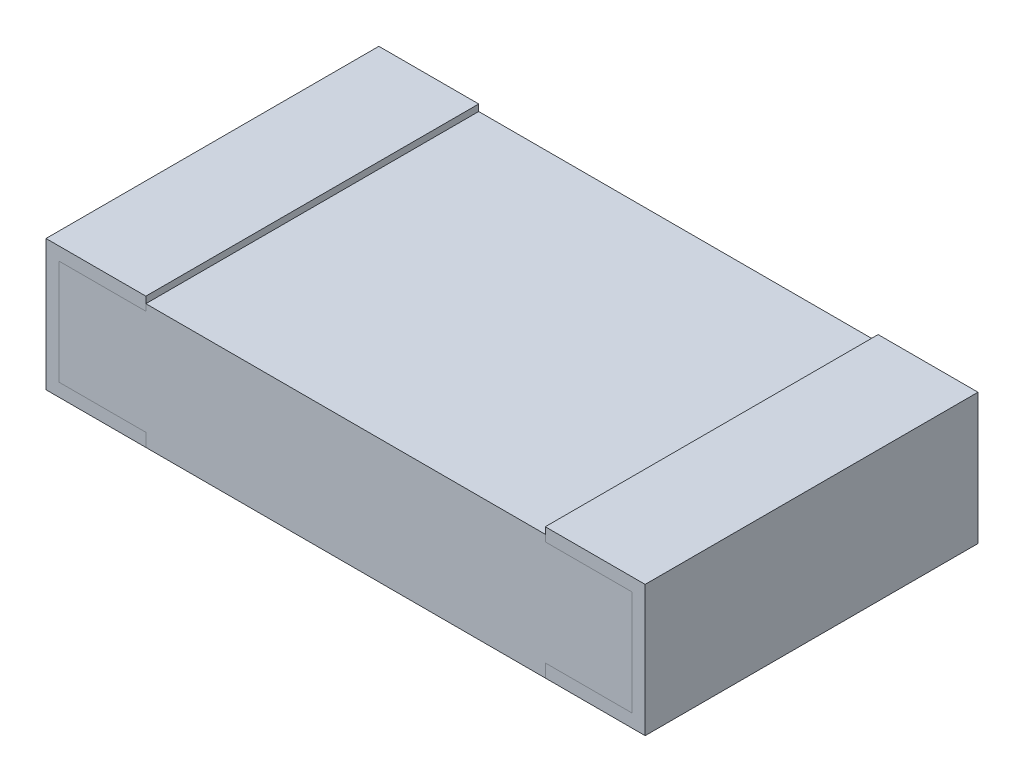
ISO-10303-21;
HEADER;
FILE_DESCRIPTION(('STEP AP214'),'2;1');
FILE_NAME('part.step','',(''),(''),'','','');
FILE_SCHEMA(('AUTOMOTIVE_DESIGN { 1 0 10303 214 1 1 1 1 }'));
ENDSEC;
DATA;
#1=APPLICATION_CONTEXT('core data for automotive mechanical design processes');
#2=APPLICATION_PROTOCOL_DEFINITION('international standard','automotive_design',2000,#1);
#3=PRODUCT_CONTEXT('',#1,'mechanical');
#4=PRODUCT('Part','Part','',(#3));
#5=PRODUCT_RELATED_PRODUCT_CATEGORY('part','',(#4));
#6=PRODUCT_DEFINITION_FORMATION('','',#4);
#7=PRODUCT_DEFINITION_CONTEXT('part definition',#1,'design');
#8=PRODUCT_DEFINITION('design','',#6,#7);
#9=PRODUCT_DEFINITION_SHAPE('','',#8);
#10=(LENGTH_UNIT() NAMED_UNIT(*) SI_UNIT(.MILLI.,.METRE.));
#11=(NAMED_UNIT(*) PLANE_ANGLE_UNIT() SI_UNIT($,.RADIAN.));
#12=(NAMED_UNIT(*) SI_UNIT($,.STERADIAN.) SOLID_ANGLE_UNIT());
#13=UNCERTAINTY_MEASURE_WITH_UNIT(LENGTH_MEASURE(1.E-05),#10,'distance_accuracy_value','');
#14=(GEOMETRIC_REPRESENTATION_CONTEXT(3) GLOBAL_UNCERTAINTY_ASSIGNED_CONTEXT((#13)) GLOBAL_UNIT_ASSIGNED_CONTEXT((#10,
#11,#12)) REPRESENTATION_CONTEXT('',''));
#15=CARTESIAN_POINT('',(0.,0.,0.));
#16=DIRECTION('',(0.,0.,1.));
#17=DIRECTION('',(1.,0.,0.));
#18=AXIS2_PLACEMENT_3D('',#15,#16,#17);
#19=CARTESIAN_POINT('',(0.762,0.,1.27));
#20=DIRECTION('',(1.,0.,0.));
#21=DIRECTION('',(0.,1.,0.));
#22=AXIS2_PLACEMENT_3D('',#19,#20,#21);
#23=PLANE('',#22);
#24=DIRECTION('',(0.,1.,0.));
#25=VECTOR('',#24,1.);
#26=CARTESIAN_POINT('',(0.762,0.,1.27));
#27=LINE('',#26,#25);
#28=CARTESIAN_POINT('',(0.762,0.,1.27));
#29=VERTEX_POINT('',#28);
#30=CARTESIAN_POINT('',(0.762,0.0499999999999999,1.27));
#31=VERTEX_POINT('',#30);
#32=EDGE_CURVE('P0_E172',#29,#31,#27,.T.);
#33=ORIENTED_EDGE('',*,*,#32,.F.);
#34=DIRECTION('',(0.,0.,1.));
#35=VECTOR('',#34,1.);
#36=CARTESIAN_POINT('',(0.762,0.,1.27));
#37=LINE('',#36,#35);
#38=CARTESIAN_POINT('',(0.762,0.,0.));
#39=VERTEX_POINT('',#38);
#40=EDGE_CURVE('P0_E133',#29,#39,#37,.F.);
#41=ORIENTED_EDGE('',*,*,#40,.T.);
#42=DIRECTION('',(0.,1.,0.));
#43=VECTOR('',#42,1.);
#44=CARTESIAN_POINT('',(0.762,0.,0.));
#45=LINE('',#44,#43);
#46=CARTESIAN_POINT('',(0.762,0.0499999999999999,0.));
#47=VERTEX_POINT('',#46);
#48=EDGE_CURVE('P0_E179',#39,#47,#45,.T.);
#49=ORIENTED_EDGE('',*,*,#48,.T.);
#50=DIRECTION('',(0.,0.,1.));
#51=VECTOR('',#50,1.);
#52=CARTESIAN_POINT('',(0.762,0.0499999999999999,1.27));
#53=LINE('',#52,#51);
#54=EDGE_CURVE('P0_E19',#47,#31,#53,.T.);
#55=ORIENTED_EDGE('',*,*,#54,.T.);
#56=EDGE_LOOP('',(#33,#41,#49,#55));
#57=FACE_BOUND('',#56,.T.);
#58=ADVANCED_FACE('P0_F16',(#57),#23,.T.);
#59=CARTESIAN_POINT('',(-1.093,0.0499999999999999,1.27));
#60=DIRECTION('',(0.,1.,0.));
#61=DIRECTION('',(0.,0.,1.));
#62=AXIS2_PLACEMENT_3D('',#59,#60,#61);
#63=PLANE('',#62);
#64=ORIENTED_EDGE('',*,*,#54,.F.);
#65=DIRECTION('',(1.,0.,0.));
#66=VECTOR('',#65,1.);
#67=CARTESIAN_POINT('',(0.,0.0499999999999999,0.));
#68=LINE('',#67,#66);
#69=CARTESIAN_POINT('',(1.093,0.0499999999999999,0.));
#70=VERTEX_POINT('',#69);
#71=EDGE_CURVE('P0_E104',#47,#70,#68,.T.);
#72=ORIENTED_EDGE('',*,*,#71,.T.);
#73=DIRECTION('',(0.,0.,1.));
#74=VECTOR('',#73,1.);
#75=CARTESIAN_POINT('',(1.093,0.0499999999999999,1.27));
#76=LINE('',#75,#74);
#77=CARTESIAN_POINT('',(1.093,0.0499999999999999,1.27));
#78=VERTEX_POINT('',#77);
#79=EDGE_CURVE('P0_E107',#78,#70,#76,.F.);
#80=ORIENTED_EDGE('',*,*,#79,.F.);
#81=DIRECTION('',(1.,0.,0.));
#82=VECTOR('',#81,1.);
#83=CARTESIAN_POINT('',(0.,0.0499999999999999,1.27));
#84=LINE('',#83,#82);
#85=EDGE_CURVE('P0_E170',#31,#78,#84,.T.);
#86=ORIENTED_EDGE('',*,*,#85,.F.);
#87=EDGE_LOOP('',(#64,#72,#80,#86));
#88=FACE_BOUND('',#87,.T.);
#89=ADVANCED_FACE('P0_F106',(#88),#63,.F.);
#90=CARTESIAN_POINT('',(1.093,0.45,1.27));
#91=DIRECTION('',(1.,0.,0.));
#92=DIRECTION('',(0.,1.,0.));
#93=AXIS2_PLACEMENT_3D('',#90,#91,#92);
#94=PLANE('',#93);
#95=DIRECTION('',(0.,1.,0.));
#96=VECTOR('',#95,1.);
#97=CARTESIAN_POINT('',(1.093,0.,1.27));
#98=LINE('',#97,#96);
#99=CARTESIAN_POINT('',(1.093,0.45,1.27));
#100=VERTEX_POINT('',#99);
#101=EDGE_CURVE('P0_E119',#78,#100,#98,.T.);
#102=ORIENTED_EDGE('',*,*,#101,.F.);
#103=ORIENTED_EDGE('',*,*,#79,.T.);
#104=DIRECTION('',(0.,1.,0.));
#105=VECTOR('',#104,1.);
#106=CARTESIAN_POINT('',(1.093,0.,0.));
#107=LINE('',#106,#105);
#108=CARTESIAN_POINT('',(1.093,0.45,0.));
#109=VERTEX_POINT('',#108);
#110=EDGE_CURVE('P0_E112',#70,#109,#107,.T.);
#111=ORIENTED_EDGE('',*,*,#110,.T.);
#112=DIRECTION('',(0.,0.,1.));
#113=VECTOR('',#112,1.);
#114=CARTESIAN_POINT('',(1.093,0.45,1.27));
#115=LINE('',#114,#113);
#116=EDGE_CURVE('P0_E113',#100,#109,#115,.F.);
#117=ORIENTED_EDGE('',*,*,#116,.F.);
#118=EDGE_LOOP('',(#102,#103,#111,#117));
#119=FACE_BOUND('',#118,.T.);
#120=ADVANCED_FACE('P0_F116',(#119),#94,.T.);
#121=CARTESIAN_POINT('',(-1.093,0.45,1.27));
#122=DIRECTION('',(0.,1.,0.));
#123=DIRECTION('',(0.,0.,1.));
#124=AXIS2_PLACEMENT_3D('',#121,#122,#123);
#125=PLANE('',#124);
#126=DIRECTION('',(1.,0.,0.));
#127=VECTOR('',#126,1.);
#128=CARTESIAN_POINT('',(0.,0.45,0.));
#129=LINE('',#128,#127);
#130=CARTESIAN_POINT('',(-0.762,0.45,0.));
#131=VERTEX_POINT('',#130);
#132=CARTESIAN_POINT('',(-1.093,0.45,0.));
#133=VERTEX_POINT('',#132);
#134=EDGE_CURVE('P0_E128',#131,#133,#129,.F.);
#135=ORIENTED_EDGE('',*,*,#134,.T.);
#136=DIRECTION('',(0.,0.,-1.));
#137=VECTOR('',#136,1.);
#138=CARTESIAN_POINT('',(-1.093,0.45,1.27));
#139=LINE('',#138,#137);
#140=CARTESIAN_POINT('',(-1.093,0.45,1.27));
#141=VERTEX_POINT('',#140);
#142=EDGE_CURVE('P0_E121',#133,#141,#139,.F.);
#143=ORIENTED_EDGE('',*,*,#142,.T.);
#144=DIRECTION('',(1.,0.,0.));
#145=VECTOR('',#144,1.);
#146=CARTESIAN_POINT('',(0.,0.45,1.27));
#147=LINE('',#146,#145);
#148=CARTESIAN_POINT('',(-0.762,0.45,1.27));
#149=VERTEX_POINT('',#148);
#150=EDGE_CURVE('P0_E147',#149,#141,#147,.F.);
#151=ORIENTED_EDGE('',*,*,#150,.F.);
#152=DIRECTION('',(0.,0.,1.));
#153=VECTOR('',#152,1.);
#154=CARTESIAN_POINT('',(-0.762,0.45,1.27));
#155=LINE('',#154,#153);
#156=EDGE_CURVE('P0_E177',#149,#131,#155,.F.);
#157=ORIENTED_EDGE('',*,*,#156,.T.);
#158=EDGE_LOOP('',(#135,#143,#151,#157));
#159=FACE_BOUND('',#158,.T.);
#160=ADVANCED_FACE('P0_F145',(#159),#125,.T.);
#161=CARTESIAN_POINT('',(-1.093,0.45,1.27));
#162=DIRECTION('',(1.,0.,0.));
#163=DIRECTION('',(0.,0.,-1.));
#164=AXIS2_PLACEMENT_3D('',#161,#162,#163);
#165=PLANE('',#164);
#166=DIRECTION('',(0.,0.,1.));
#167=VECTOR('',#166,1.);
#168=CARTESIAN_POINT('',(-1.093,0.0499999999999999,1.27));
#169=LINE('',#168,#167);
#170=CARTESIAN_POINT('',(-1.093,0.0499999999999999,0.));
#171=VERTEX_POINT('',#170);
#172=CARTESIAN_POINT('',(-1.093,0.0499999999999999,1.27));
#173=VERTEX_POINT('',#172);
#174=EDGE_CURVE('P0_E139',#171,#173,#169,.T.);
#175=ORIENTED_EDGE('',*,*,#174,.T.);
#176=DIRECTION('',(0.,1.,0.));
#177=VECTOR('',#176,1.);
#178=CARTESIAN_POINT('',(-1.093,0.,1.27));
#179=LINE('',#178,#177);
#180=EDGE_CURVE('P0_E153',#141,#173,#179,.F.);
#181=ORIENTED_EDGE('',*,*,#180,.F.);
#182=ORIENTED_EDGE('',*,*,#142,.F.);
#183=DIRECTION('',(0.,1.,0.));
#184=VECTOR('',#183,1.);
#185=CARTESIAN_POINT('',(-1.093,0.,0.));
#186=LINE('',#185,#184);
#187=EDGE_CURVE('P0_E188',#133,#171,#186,.F.);
#188=ORIENTED_EDGE('',*,*,#187,.T.);
#189=EDGE_LOOP('',(#175,#181,#182,#188));
#190=FACE_BOUND('',#189,.T.);
#191=ADVANCED_FACE('P0_F154',(#190),#165,.F.);
#192=CARTESIAN_POINT('',(-1.093,0.0499999999999999,1.27));
#193=DIRECTION('',(0.,1.,0.));
#194=DIRECTION('',(0.,0.,1.));
#195=AXIS2_PLACEMENT_3D('',#192,#193,#194);
#196=PLANE('',#195);
#197=DIRECTION('',(1.,0.,0.));
#198=VECTOR('',#197,1.);
#199=CARTESIAN_POINT('',(0.,0.0499999999999999,1.27));
#200=LINE('',#199,#198);
#201=CARTESIAN_POINT('',(-0.762,0.0499999999999999,1.27));
#202=VERTEX_POINT('',#201);
#203=EDGE_CURVE('P0_E158',#173,#202,#200,.T.);
#204=ORIENTED_EDGE('',*,*,#203,.F.);
#205=ORIENTED_EDGE('',*,*,#174,.F.);
#206=DIRECTION('',(1.,0.,0.));
#207=VECTOR('',#206,1.);
#208=CARTESIAN_POINT('',(0.,0.0499999999999999,0.));
#209=LINE('',#208,#207);
#210=CARTESIAN_POINT('',(-0.762,0.0499999999999999,0.));
#211=VERTEX_POINT('',#210);
#212=EDGE_CURVE('P0_E186',#171,#211,#209,.T.);
#213=ORIENTED_EDGE('',*,*,#212,.T.);
#214=DIRECTION('',(0.,0.,1.));
#215=VECTOR('',#214,1.);
#216=CARTESIAN_POINT('',(-0.762,0.0499999999999999,1.27));
#217=LINE('',#216,#215);
#218=EDGE_CURVE('P0_E137',#211,#202,#217,.T.);
#219=ORIENTED_EDGE('',*,*,#218,.T.);
#220=EDGE_LOOP('',(#204,#205,#213,#219));
#221=FACE_BOUND('',#220,.T.);
#222=ADVANCED_FACE('P0_F191',(#221),#196,.F.);
#223=CARTESIAN_POINT('',(-0.762,0.,1.27));
#224=DIRECTION('',(1.,0.,0.));
#225=DIRECTION('',(0.,1.,0.));
#226=AXIS2_PLACEMENT_3D('',#223,#224,#225);
#227=PLANE('',#226);
#228=DIRECTION('',(0.,0.,1.));
#229=VECTOR('',#228,1.);
#230=CARTESIAN_POINT('',(-0.762,0.,1.27));
#231=LINE('',#230,#229);
#232=CARTESIAN_POINT('',(-0.762,0.,0.));
#233=VERTEX_POINT('',#232);
#234=CARTESIAN_POINT('',(-0.762,0.,1.27));
#235=VERTEX_POINT('',#234);
#236=EDGE_CURVE('P0_E135',#233,#235,#231,.T.);
#237=ORIENTED_EDGE('',*,*,#236,.T.);
#238=DIRECTION('',(0.,1.,0.));
#239=VECTOR('',#238,1.);
#240=CARTESIAN_POINT('',(-0.762,0.,1.27));
#241=LINE('',#240,#239);
#242=EDGE_CURVE('P0_E205',#202,#235,#241,.F.);
#243=ORIENTED_EDGE('',*,*,#242,.F.);
#244=ORIENTED_EDGE('',*,*,#218,.F.);
#245=DIRECTION('',(0.,1.,0.));
#246=VECTOR('',#245,1.);
#247=CARTESIAN_POINT('',(-0.762,0.,0.));
#248=LINE('',#247,#246);
#249=EDGE_CURVE('P0_E184',#211,#233,#248,.F.);
#250=ORIENTED_EDGE('',*,*,#249,.T.);
#251=EDGE_LOOP('',(#237,#243,#244,#250));
#252=FACE_BOUND('',#251,.T.);
#253=ADVANCED_FACE('P0_F196',(#252),#227,.F.);
#254=CARTESIAN_POINT('',(0.,0.,1.27));
#255=DIRECTION('',(0.,1.,0.));
#256=DIRECTION('',(0.,0.,1.));
#257=AXIS2_PLACEMENT_3D('',#254,#255,#256);
#258=PLANE('',#257);
#259=ORIENTED_EDGE('',*,*,#40,.F.);
#260=DIRECTION('',(1.,0.,0.));
#261=VECTOR('',#260,1.);
#262=CARTESIAN_POINT('',(0.,0.,1.27));
#263=LINE('',#262,#261);
#264=EDGE_CURVE('P0_E203',#235,#29,#263,.T.);
#265=ORIENTED_EDGE('',*,*,#264,.F.);
#266=ORIENTED_EDGE('',*,*,#236,.F.);
#267=DIRECTION('',(1.,0.,0.));
#268=VECTOR('',#267,1.);
#269=CARTESIAN_POINT('',(0.,0.,0.));
#270=LINE('',#269,#268);
#271=EDGE_CURVE('P0_E181',#233,#39,#270,.T.);
#272=ORIENTED_EDGE('',*,*,#271,.T.);
#273=EDGE_LOOP('',(#259,#265,#266,#272));
#274=FACE_BOUND('',#273,.T.);
#275=ADVANCED_FACE('P0_F201',(#274),#258,.F.);
#276=CARTESIAN_POINT('',(-1.093,0.45,1.27));
#277=DIRECTION('',(0.,1.,0.));
#278=DIRECTION('',(0.,0.,1.));
#279=AXIS2_PLACEMENT_3D('',#276,#277,#278);
#280=PLANE('',#279);
#281=ORIENTED_EDGE('',*,*,#116,.T.);
#282=DIRECTION('',(1.,0.,0.));
#283=VECTOR('',#282,1.);
#284=CARTESIAN_POINT('',(0.,0.45,0.));
#285=LINE('',#284,#283);
#286=CARTESIAN_POINT('',(0.762,0.45,0.));
#287=VERTEX_POINT('',#286);
#288=EDGE_CURVE('P0_E126',#109,#287,#285,.F.);
#289=ORIENTED_EDGE('',*,*,#288,.T.);
#290=DIRECTION('',(0.,0.,1.));
#291=VECTOR('',#290,1.);
#292=CARTESIAN_POINT('',(0.762,0.45,1.27));
#293=LINE('',#292,#291);
#294=CARTESIAN_POINT('',(0.762,0.45,1.27));
#295=VERTEX_POINT('',#294);
#296=EDGE_CURVE('P0_E212',#295,#287,#293,.F.);
#297=ORIENTED_EDGE('',*,*,#296,.F.);
#298=DIRECTION('',(1.,0.,0.));
#299=VECTOR('',#298,1.);
#300=CARTESIAN_POINT('',(0.,0.45,1.27));
#301=LINE('',#300,#299);
#302=EDGE_CURVE('P0_E164',#100,#295,#301,.F.);
#303=ORIENTED_EDGE('',*,*,#302,.F.);
#304=EDGE_LOOP('',(#281,#289,#297,#303));
#305=FACE_BOUND('',#304,.T.);
#306=ADVANCED_FACE('P0_F233',(#305),#280,.T.);
#307=CARTESIAN_POINT('',(0.,0.,0.));
#308=DIRECTION('',(0.,0.,1.));
#309=DIRECTION('',(1.,0.,0.));
#310=AXIS2_PLACEMENT_3D('',#307,#308,#309);
#311=PLANE('',#310);
#312=ORIENTED_EDGE('',*,*,#271,.F.);
#313=ORIENTED_EDGE('',*,*,#249,.F.);
#314=ORIENTED_EDGE('',*,*,#212,.F.);
#315=ORIENTED_EDGE('',*,*,#187,.F.);
#316=ORIENTED_EDGE('',*,*,#134,.F.);
#317=DIRECTION('',(0.,1.,0.));
#318=VECTOR('',#317,1.);
#319=CARTESIAN_POINT('',(-0.762,0.,0.));
#320=LINE('',#319,#318);
#321=CARTESIAN_POINT('',(-0.762,0.475,0.));
#322=VERTEX_POINT('',#321);
#323=EDGE_CURVE('P0_E175',#131,#322,#320,.T.);
#324=ORIENTED_EDGE('',*,*,#323,.T.);
#325=DIRECTION('',(1.,0.,0.));
#326=VECTOR('',#325,1.);
#327=CARTESIAN_POINT('',(0.,0.475,0.));
#328=LINE('',#327,#326);
#329=CARTESIAN_POINT('',(0.762,0.475,0.));
#330=VERTEX_POINT('',#329);
#331=EDGE_CURVE('P0_E215',#330,#322,#328,.F.);
#332=ORIENTED_EDGE('',*,*,#331,.F.);
#333=DIRECTION('',(0.,1.,0.));
#334=VECTOR('',#333,1.);
#335=CARTESIAN_POINT('',(0.762,0.,0.));
#336=LINE('',#335,#334);
#337=EDGE_CURVE('P0_E204',#287,#330,#336,.T.);
#338=ORIENTED_EDGE('',*,*,#337,.F.);
#339=ORIENTED_EDGE('',*,*,#288,.F.);
#340=ORIENTED_EDGE('',*,*,#110,.F.);
#341=ORIENTED_EDGE('',*,*,#71,.F.);
#342=ORIENTED_EDGE('',*,*,#48,.F.);
#343=EDGE_LOOP('',(#312,#313,#314,#315,#316,#324,#332,#338,#339,#340,#341,#342));
#344=FACE_BOUND('',#343,.T.);
#345=ADVANCED_FACE('P0_F124',(#344),#311,.F.);
#346=CARTESIAN_POINT('',(-0.762,0.,1.27));
#347=DIRECTION('',(1.,0.,0.));
#348=DIRECTION('',(0.,1.,0.));
#349=AXIS2_PLACEMENT_3D('',#346,#347,#348);
#350=PLANE('',#349);
#351=ORIENTED_EDGE('',*,*,#156,.F.);
#352=DIRECTION('',(0.,1.,0.));
#353=VECTOR('',#352,1.);
#354=CARTESIAN_POINT('',(-0.762,0.,1.27));
#355=LINE('',#354,#353);
#356=CARTESIAN_POINT('',(-0.762,0.475,1.27));
#357=VERTEX_POINT('',#356);
#358=EDGE_CURVE('P0_E162',#357,#149,#355,.F.);
#359=ORIENTED_EDGE('',*,*,#358,.F.);
#360=DIRECTION('',(0.,0.,1.));
#361=VECTOR('',#360,1.);
#362=CARTESIAN_POINT('',(-0.762,0.475,1.27));
#363=LINE('',#362,#361);
#364=EDGE_CURVE('P0_E218',#322,#357,#363,.T.);
#365=ORIENTED_EDGE('',*,*,#364,.F.);
#366=ORIENTED_EDGE('',*,*,#323,.F.);
#367=EDGE_LOOP('',(#351,#359,#365,#366));
#368=FACE_BOUND('',#367,.T.);
#369=ADVANCED_FACE('P0_F227',(#368),#350,.F.);
#370=CARTESIAN_POINT('',(0.,0.,1.27));
#371=DIRECTION('',(0.,0.,1.));
#372=DIRECTION('',(1.,0.,0.));
#373=AXIS2_PLACEMENT_3D('',#370,#371,#372);
#374=PLANE('',#373);
#375=ORIENTED_EDGE('',*,*,#242,.T.);
#376=ORIENTED_EDGE('',*,*,#264,.T.);
#377=ORIENTED_EDGE('',*,*,#32,.T.);
#378=ORIENTED_EDGE('',*,*,#85,.T.);
#379=ORIENTED_EDGE('',*,*,#101,.T.);
#380=ORIENTED_EDGE('',*,*,#302,.T.);
#381=DIRECTION('',(0.,1.,0.));
#382=VECTOR('',#381,1.);
#383=CARTESIAN_POINT('',(0.762,0.,1.27));
#384=LINE('',#383,#382);
#385=CARTESIAN_POINT('',(0.762,0.475,1.27));
#386=VERTEX_POINT('',#385);
#387=EDGE_CURVE('P0_E34',#386,#295,#384,.F.);
#388=ORIENTED_EDGE('',*,*,#387,.F.);
#389=DIRECTION('',(1.,0.,0.));
#390=VECTOR('',#389,1.);
#391=CARTESIAN_POINT('',(0.,0.475,1.27));
#392=LINE('',#391,#390);
#393=EDGE_CURVE('P0_E25',#357,#386,#392,.T.);
#394=ORIENTED_EDGE('',*,*,#393,.F.);
#395=ORIENTED_EDGE('',*,*,#358,.T.);
#396=ORIENTED_EDGE('',*,*,#150,.T.);
#397=ORIENTED_EDGE('',*,*,#180,.T.);
#398=ORIENTED_EDGE('',*,*,#203,.T.);
#399=EDGE_LOOP('',(#375,#376,#377,#378,#379,#380,#388,#394,#395,#396,#397,#398));
#400=FACE_BOUND('',#399,.T.);
#401=ADVANCED_FACE('P0_F161',(#400),#374,.T.);
#402=CARTESIAN_POINT('',(0.762,0.,1.27));
#403=DIRECTION('',(1.,0.,0.));
#404=DIRECTION('',(0.,1.,0.));
#405=AXIS2_PLACEMENT_3D('',#402,#403,#404);
#406=PLANE('',#405);
#407=ORIENTED_EDGE('',*,*,#387,.T.);
#408=ORIENTED_EDGE('',*,*,#296,.T.);
#409=ORIENTED_EDGE('',*,*,#337,.T.);
#410=DIRECTION('',(0.,0.,1.));
#411=VECTOR('',#410,1.);
#412=CARTESIAN_POINT('',(0.762,0.475,1.27));
#413=LINE('',#412,#411);
#414=EDGE_CURVE('P0_E11',#386,#330,#413,.F.);
#415=ORIENTED_EDGE('',*,*,#414,.F.);
#416=EDGE_LOOP('',(#407,#408,#409,#415));
#417=FACE_BOUND('',#416,.T.);
#418=ADVANCED_FACE('P0_F229',(#417),#406,.T.);
#419=CARTESIAN_POINT('',(0.,0.475,1.27));
#420=DIRECTION('',(0.,1.,0.));
#421=DIRECTION('',(0.,0.,1.));
#422=AXIS2_PLACEMENT_3D('',#419,#420,#421);
#423=PLANE('',#422);
#424=ORIENTED_EDGE('',*,*,#393,.T.);
#425=ORIENTED_EDGE('',*,*,#414,.T.);
#426=ORIENTED_EDGE('',*,*,#331,.T.);
#427=ORIENTED_EDGE('',*,*,#364,.T.);
#428=EDGE_LOOP('',(#424,#425,#426,#427));
#429=FACE_BOUND('',#428,.T.);
#430=ADVANCED_FACE('P0_F223',(#429),#423,.T.);
#431=CLOSED_SHELL('',(#58,#89,#120,#160,#191,#222,#253,#275,#306,#345,#369,#401,#418,#430));
#432=MANIFOLD_SOLID_BREP('P0_B1',#431);
#433=CARTESIAN_POINT('',(-0.762,0.,1.27));
#434=DIRECTION('',(1.,0.,0.));
#435=DIRECTION('',(0.,1.,0.));
#436=AXIS2_PLACEMENT_3D('',#433,#434,#435);
#437=PLANE('',#436);
#438=DIRECTION('',(0.,1.,0.));
#439=VECTOR('',#438,1.);
#440=CARTESIAN_POINT('',(-0.762,0.,1.27));
#441=LINE('',#440,#439);
#442=CARTESIAN_POINT('',(-0.762,0.,1.27));
#443=VERTEX_POINT('',#442);
#444=CARTESIAN_POINT('',(-0.762,0.0499999999999999,1.27));
#445=VERTEX_POINT('',#444);
#446=EDGE_CURVE('P1_E105',#443,#445,#441,.T.);
#447=ORIENTED_EDGE('',*,*,#446,.F.);
#448=DIRECTION('',(0.,0.,1.));
#449=VECTOR('',#448,1.);
#450=CARTESIAN_POINT('',(-0.762,0.,1.27));
#451=LINE('',#450,#449);
#452=CARTESIAN_POINT('',(-0.762,0.,0.));
#453=VERTEX_POINT('',#452);
#454=EDGE_CURVE('P1_E135',#443,#453,#451,.F.);
#455=ORIENTED_EDGE('',*,*,#454,.T.);
#456=DIRECTION('',(0.,1.,0.));
#457=VECTOR('',#456,1.);
#458=CARTESIAN_POINT('',(-0.762,0.,0.));
#459=LINE('',#458,#457);
#460=CARTESIAN_POINT('',(-0.762,0.0499999999999999,0.));
#461=VERTEX_POINT('',#460);
#462=EDGE_CURVE('P1_E131',#453,#461,#459,.T.);
#463=ORIENTED_EDGE('',*,*,#462,.T.);
#464=DIRECTION('',(0.,0.,1.));
#465=VECTOR('',#464,1.);
#466=CARTESIAN_POINT('',(-0.762,0.0499999999999999,1.27));
#467=LINE('',#466,#465);
#468=EDGE_CURVE('P1_E19',#445,#461,#467,.F.);
#469=ORIENTED_EDGE('',*,*,#468,.F.);
#470=EDGE_LOOP('',(#447,#455,#463,#469));
#471=FACE_BOUND('',#470,.T.);
#472=ADVANCED_FACE('P1_F16',(#471),#437,.T.);
#473=CARTESIAN_POINT('',(0.,0.0499999999999999,1.27));
#474=DIRECTION('',(0.,1.,0.));
#475=DIRECTION('',(0.,0.,1.));
#476=AXIS2_PLACEMENT_3D('',#473,#474,#475);
#477=PLANE('',#476);
#478=DIRECTION('',(1.,0.,0.));
#479=VECTOR('',#478,1.);
#480=CARTESIAN_POINT('',(0.,0.0499999999999999,1.27));
#481=LINE('',#480,#479);
#482=CARTESIAN_POINT('',(-1.093,0.0499999999999999,1.27));
#483=VERTEX_POINT('',#482);
#484=EDGE_CURVE('P1_E107',#445,#483,#481,.F.);
#485=ORIENTED_EDGE('',*,*,#484,.F.);
#486=ORIENTED_EDGE('',*,*,#468,.T.);
#487=DIRECTION('',(1.,0.,0.));
#488=VECTOR('',#487,1.);
#489=CARTESIAN_POINT('',(0.,0.0499999999999999,0.));
#490=LINE('',#489,#488);
#491=CARTESIAN_POINT('',(-1.093,0.0499999999999999,0.));
#492=VERTEX_POINT('',#491);
#493=EDGE_CURVE('P1_E126',#461,#492,#490,.F.);
#494=ORIENTED_EDGE('',*,*,#493,.T.);
#495=DIRECTION('',(0.,0.,-1.));
#496=VECTOR('',#495,1.);
#497=CARTESIAN_POINT('',(-1.093,0.0499999999999999,1.27));
#498=LINE('',#497,#496);
#499=EDGE_CURVE('P1_E114',#483,#492,#498,.T.);
#500=ORIENTED_EDGE('',*,*,#499,.F.);
#501=EDGE_LOOP('',(#485,#486,#494,#500));
#502=FACE_BOUND('',#501,.T.);
#503=ADVANCED_FACE('P1_F125',(#502),#477,.T.);
#504=CARTESIAN_POINT('',(-1.093,0.,1.27));
#505=DIRECTION('',(1.,0.,0.));
#506=DIRECTION('',(0.,0.,-1.));
#507=AXIS2_PLACEMENT_3D('',#504,#505,#506);
#508=PLANE('',#507);
#509=DIRECTION('',(0.,1.,0.));
#510=VECTOR('',#509,1.);
#511=CARTESIAN_POINT('',(-1.093,0.,1.27));
#512=LINE('',#511,#510);
#513=CARTESIAN_POINT('',(-1.093,0.45,1.27));
#514=VERTEX_POINT('',#513);
#515=EDGE_CURVE('P1_E147',#483,#514,#512,.T.);
#516=ORIENTED_EDGE('',*,*,#515,.F.);
#517=ORIENTED_EDGE('',*,*,#499,.T.);
#518=DIRECTION('',(0.,1.,0.));
#519=VECTOR('',#518,1.);
#520=CARTESIAN_POINT('',(-1.093,0.,0.));
#521=LINE('',#520,#519);
#522=CARTESIAN_POINT('',(-1.093,0.45,0.));
#523=VERTEX_POINT('',#522);
#524=EDGE_CURVE('P1_E132',#492,#523,#521,.T.);
#525=ORIENTED_EDGE('',*,*,#524,.T.);
#526=DIRECTION('',(0.,0.,1.));
#527=VECTOR('',#526,1.);
#528=CARTESIAN_POINT('',(-1.093,0.45,1.27));
#529=LINE('',#528,#527);
#530=EDGE_CURVE('P1_E112',#523,#514,#529,.T.);
#531=ORIENTED_EDGE('',*,*,#530,.T.);
#532=EDGE_LOOP('',(#516,#517,#525,#531));
#533=FACE_BOUND('',#532,.T.);
#534=ADVANCED_FACE('P1_F148',(#533),#508,.T.);
#535=CARTESIAN_POINT('',(0.,0.45,1.27));
#536=DIRECTION('',(0.,1.,0.));
#537=DIRECTION('',(0.,0.,1.));
#538=AXIS2_PLACEMENT_3D('',#535,#536,#537);
#539=PLANE('',#538);
#540=DIRECTION('',(0.,0.,1.));
#541=VECTOR('',#540,1.);
#542=CARTESIAN_POINT('',(-0.762,0.45,1.27));
#543=LINE('',#542,#541);
#544=CARTESIAN_POINT('',(-0.762,0.45,1.27));
#545=VERTEX_POINT('',#544);
#546=CARTESIAN_POINT('',(-0.762,0.45,0.));
#547=VERTEX_POINT('',#546);
#548=EDGE_CURVE('P1_E78',#545,#547,#543,.F.);
#549=ORIENTED_EDGE('',*,*,#548,.F.);
#550=DIRECTION('',(1.,0.,0.));
#551=VECTOR('',#550,1.);
#552=CARTESIAN_POINT('',(0.,0.45,1.27));
#553=LINE('',#552,#551);
#554=EDGE_CURVE('P1_E90',#514,#545,#553,.T.);
#555=ORIENTED_EDGE('',*,*,#554,.F.);
#556=ORIENTED_EDGE('',*,*,#530,.F.);
#557=DIRECTION('',(1.,0.,0.));
#558=VECTOR('',#557,1.);
#559=CARTESIAN_POINT('',(0.,0.45,0.));
#560=LINE('',#559,#558);
#561=EDGE_CURVE('P1_E248',#523,#547,#560,.T.);
#562=ORIENTED_EDGE('',*,*,#561,.T.);
#563=EDGE_LOOP('',(#549,#555,#556,#562));
#564=FACE_BOUND('',#563,.T.);
#565=ADVANCED_FACE('P1_F149',(#564),#539,.F.);
#566=CARTESIAN_POINT('',(-0.762,0.,1.27));
#567=DIRECTION('',(1.,0.,0.));
#568=DIRECTION('',(0.,1.,0.));
#569=AXIS2_PLACEMENT_3D('',#566,#567,#568);
#570=PLANE('',#569);
#571=DIRECTION('',(0.,1.,0.));
#572=VECTOR('',#571,1.);
#573=CARTESIAN_POINT('',(-0.762,0.,1.27));
#574=LINE('',#573,#572);
#575=CARTESIAN_POINT('',(-0.762,0.5,1.27));
#576=VERTEX_POINT('',#575);
#577=EDGE_CURVE('P1_E83',#545,#576,#574,.T.);
#578=ORIENTED_EDGE('',*,*,#577,.F.);
#579=ORIENTED_EDGE('',*,*,#548,.T.);
#580=DIRECTION('',(0.,1.,0.));
#581=VECTOR('',#580,1.);
#582=CARTESIAN_POINT('',(-0.762,0.,0.));
#583=LINE('',#582,#581);
#584=CARTESIAN_POINT('',(-0.762,0.5,0.));
#585=VERTEX_POINT('',#584);
#586=EDGE_CURVE('P1_E97',#547,#585,#583,.T.);
#587=ORIENTED_EDGE('',*,*,#586,.T.);
#588=DIRECTION('',(0.,0.,1.));
#589=VECTOR('',#588,1.);
#590=CARTESIAN_POINT('',(-0.762,0.5,1.27));
#591=LINE('',#590,#589);
#592=EDGE_CURVE('P1_E92',#576,#585,#591,.F.);
#593=ORIENTED_EDGE('',*,*,#592,.F.);
#594=EDGE_LOOP('',(#578,#579,#587,#593));
#595=FACE_BOUND('',#594,.T.);
#596=ADVANCED_FACE('P1_F95',(#595),#570,.T.);
#597=CARTESIAN_POINT('',(0.,0.5,1.27));
#598=DIRECTION('',(0.,1.,0.));
#599=DIRECTION('',(0.,0.,1.));
#600=AXIS2_PLACEMENT_3D('',#597,#598,#599);
#601=PLANE('',#600);
#602=DIRECTION('',(1.,0.,0.));
#603=VECTOR('',#602,1.);
#604=CARTESIAN_POINT('',(0.,0.5,1.27));
#605=LINE('',#604,#603);
#606=CARTESIAN_POINT('',(-1.143,0.5,1.27));
#607=VERTEX_POINT('',#606);
#608=EDGE_CURVE('P1_E88',#576,#607,#605,.F.);
#609=ORIENTED_EDGE('',*,*,#608,.F.);
#610=ORIENTED_EDGE('',*,*,#592,.T.);
#611=DIRECTION('',(1.,0.,0.));
#612=VECTOR('',#611,1.);
#613=CARTESIAN_POINT('',(0.,0.5,0.));
#614=LINE('',#613,#612);
#615=CARTESIAN_POINT('',(-1.143,0.5,0.));
#616=VERTEX_POINT('',#615);
#617=EDGE_CURVE('P1_E137',#585,#616,#614,.F.);
#618=ORIENTED_EDGE('',*,*,#617,.T.);
#619=DIRECTION('',(0.,0.,-1.));
#620=VECTOR('',#619,1.);
#621=CARTESIAN_POINT('',(-1.143,0.5,1.27));
#622=LINE('',#621,#620);
#623=EDGE_CURVE('P1_E104',#616,#607,#622,.F.);
#624=ORIENTED_EDGE('',*,*,#623,.T.);
#625=EDGE_LOOP('',(#609,#610,#618,#624));
#626=FACE_BOUND('',#625,.T.);
#627=ADVANCED_FACE('P1_F103',(#626),#601,.T.);
#628=CARTESIAN_POINT('',(0.,0.,1.27));
#629=DIRECTION('',(0.,0.,1.));
#630=DIRECTION('',(1.,0.,0.));
#631=AXIS2_PLACEMENT_3D('',#628,#629,#630);
#632=PLANE('',#631);
#633=ORIENTED_EDGE('',*,*,#515,.T.);
#634=ORIENTED_EDGE('',*,*,#554,.T.);
#635=ORIENTED_EDGE('',*,*,#577,.T.);
#636=ORIENTED_EDGE('',*,*,#608,.T.);
#637=DIRECTION('',(0.,1.,0.));
#638=VECTOR('',#637,1.);
#639=CARTESIAN_POINT('',(-1.143,0.,1.27));
#640=LINE('',#639,#638);
#641=CARTESIAN_POINT('',(-1.143,0.,1.27));
#642=VERTEX_POINT('',#641);
#643=EDGE_CURVE('P1_E242',#607,#642,#640,.F.);
#644=ORIENTED_EDGE('',*,*,#643,.T.);
#645=DIRECTION('',(1.,0.,0.));
#646=VECTOR('',#645,1.);
#647=CARTESIAN_POINT('',(0.,0.,1.27));
#648=LINE('',#647,#646);
#649=EDGE_CURVE('P1_E143',#642,#443,#648,.T.);
#650=ORIENTED_EDGE('',*,*,#649,.T.);
#651=ORIENTED_EDGE('',*,*,#446,.T.);
#652=ORIENTED_EDGE('',*,*,#484,.T.);
#653=EDGE_LOOP('',(#633,#634,#635,#636,#644,#650,#651,#652));
#654=FACE_BOUND('',#653,.T.);
#655=ADVANCED_FACE('P1_F85',(#654),#632,.T.);
#656=CARTESIAN_POINT('',(0.,0.,1.27));
#657=DIRECTION('',(0.,1.,0.));
#658=DIRECTION('',(0.,0.,1.));
#659=AXIS2_PLACEMENT_3D('',#656,#657,#658);
#660=PLANE('',#659);
#661=ORIENTED_EDGE('',*,*,#454,.F.);
#662=ORIENTED_EDGE('',*,*,#649,.F.);
#663=DIRECTION('',(0.,0.,-1.));
#664=VECTOR('',#663,1.);
#665=CARTESIAN_POINT('',(-1.143,0.,1.27));
#666=LINE('',#665,#664);
#667=CARTESIAN_POINT('',(-1.143,0.,0.));
#668=VERTEX_POINT('',#667);
#669=EDGE_CURVE('P1_E25',#642,#668,#666,.T.);
#670=ORIENTED_EDGE('',*,*,#669,.T.);
#671=DIRECTION('',(1.,0.,0.));
#672=VECTOR('',#671,1.);
#673=CARTESIAN_POINT('',(0.,0.,0.));
#674=LINE('',#673,#672);
#675=EDGE_CURVE('P1_E33',#668,#453,#674,.T.);
#676=ORIENTED_EDGE('',*,*,#675,.T.);
#677=EDGE_LOOP('',(#661,#662,#670,#676));
#678=FACE_BOUND('',#677,.T.);
#679=ADVANCED_FACE('P1_F166',(#678),#660,.F.);
#680=CARTESIAN_POINT('',(0.,0.,0.));
#681=DIRECTION('',(0.,0.,1.));
#682=DIRECTION('',(1.,0.,0.));
#683=AXIS2_PLACEMENT_3D('',#680,#681,#682);
#684=PLANE('',#683);
#685=ORIENTED_EDGE('',*,*,#561,.F.);
#686=ORIENTED_EDGE('',*,*,#524,.F.);
#687=ORIENTED_EDGE('',*,*,#493,.F.);
#688=ORIENTED_EDGE('',*,*,#462,.F.);
#689=ORIENTED_EDGE('',*,*,#675,.F.);
#690=DIRECTION('',(0.,1.,0.));
#691=VECTOR('',#690,1.);
#692=CARTESIAN_POINT('',(-1.143,0.,0.));
#693=LINE('',#692,#691);
#694=EDGE_CURVE('P1_E11',#668,#616,#693,.T.);
#695=ORIENTED_EDGE('',*,*,#694,.T.);
#696=ORIENTED_EDGE('',*,*,#617,.F.);
#697=ORIENTED_EDGE('',*,*,#586,.F.);
#698=EDGE_LOOP('',(#685,#686,#687,#688,#689,#695,#696,#697));
#699=FACE_BOUND('',#698,.T.);
#700=ADVANCED_FACE('P1_F130',(#699),#684,.F.);
#701=CARTESIAN_POINT('',(-1.143,0.,1.27));
#702=DIRECTION('',(1.,0.,0.));
#703=DIRECTION('',(0.,0.,-1.));
#704=AXIS2_PLACEMENT_3D('',#701,#702,#703);
#705=PLANE('',#704);
#706=ORIENTED_EDGE('',*,*,#669,.F.);
#707=ORIENTED_EDGE('',*,*,#643,.F.);
#708=ORIENTED_EDGE('',*,*,#623,.F.);
#709=ORIENTED_EDGE('',*,*,#694,.F.);
#710=EDGE_LOOP('',(#706,#707,#708,#709));
#711=FACE_BOUND('',#710,.T.);
#712=ADVANCED_FACE('P1_F159',(#711),#705,.F.);
#713=CLOSED_SHELL('',(#472,#503,#534,#565,#596,#627,#655,#679,#700,#712));
#714=MANIFOLD_SOLID_BREP('P1_B1',#713);
#715=CARTESIAN_POINT('',(0.762,0.,1.27));
#716=DIRECTION('',(1.,0.,0.));
#717=DIRECTION('',(0.,1.,0.));
#718=AXIS2_PLACEMENT_3D('',#715,#716,#717);
#719=PLANE('',#718);
#720=DIRECTION('',(0.,0.,1.));
#721=VECTOR('',#720,1.);
#722=CARTESIAN_POINT('',(0.762,0.45,1.27));
#723=LINE('',#722,#721);
#724=CARTESIAN_POINT('',(0.762,0.45,0.));
#725=VERTEX_POINT('',#724);
#726=CARTESIAN_POINT('',(0.762,0.45,1.27));
#727=VERTEX_POINT('',#726);
#728=EDGE_CURVE('P2_E19',#725,#727,#723,.T.);
#729=ORIENTED_EDGE('',*,*,#728,.T.);
#730=DIRECTION('',(0.,1.,0.));
#731=VECTOR('',#730,1.);
#732=CARTESIAN_POINT('',(0.762,0.,1.27));
#733=LINE('',#732,#731);
#734=CARTESIAN_POINT('',(0.762,0.5,1.27));
#735=VERTEX_POINT('',#734);
#736=EDGE_CURVE('P2_E120',#735,#727,#733,.F.);
#737=ORIENTED_EDGE('',*,*,#736,.F.);
#738=DIRECTION('',(0.,0.,1.));
#739=VECTOR('',#738,1.);
#740=CARTESIAN_POINT('',(0.762,0.5,1.27));
#741=LINE('',#740,#739);
#742=CARTESIAN_POINT('',(0.762,0.5,0.));
#743=VERTEX_POINT('',#742);
#744=EDGE_CURVE('P2_E87',#743,#735,#741,.T.);
#745=ORIENTED_EDGE('',*,*,#744,.F.);
#746=DIRECTION('',(0.,1.,0.));
#747=VECTOR('',#746,1.);
#748=CARTESIAN_POINT('',(0.762,0.,0.));
#749=LINE('',#748,#747);
#750=EDGE_CURVE('P2_E84',#743,#725,#749,.F.);
#751=ORIENTED_EDGE('',*,*,#750,.T.);
#752=EDGE_LOOP('',(#729,#737,#745,#751));
#753=FACE_BOUND('',#752,.T.);
#754=ADVANCED_FACE('P2_F16',(#753),#719,.F.);
#755=CARTESIAN_POINT('',(0.,0.45,1.27));
#756=DIRECTION('',(0.,1.,0.));
#757=DIRECTION('',(0.,0.,1.));
#758=AXIS2_PLACEMENT_3D('',#755,#756,#757);
#759=PLANE('',#758);
#760=DIRECTION('',(0.,0.,1.));
#761=VECTOR('',#760,1.);
#762=CARTESIAN_POINT('',(1.093,0.45,1.27));
#763=LINE('',#762,#761);
#764=CARTESIAN_POINT('',(1.093,0.45,0.));
#765=VERTEX_POINT('',#764);
#766=CARTESIAN_POINT('',(1.093,0.45,1.27));
#767=VERTEX_POINT('',#766);
#768=EDGE_CURVE('P2_E96',#765,#767,#763,.T.);
#769=ORIENTED_EDGE('',*,*,#768,.T.);
#770=DIRECTION('',(1.,0.,0.));
#771=VECTOR('',#770,1.);
#772=CARTESIAN_POINT('',(0.,0.45,1.27));
#773=LINE('',#772,#771);
#774=EDGE_CURVE('P2_E94',#727,#767,#773,.T.);
#775=ORIENTED_EDGE('',*,*,#774,.F.);
#776=ORIENTED_EDGE('',*,*,#728,.F.);
#777=DIRECTION('',(1.,0.,0.));
#778=VECTOR('',#777,1.);
#779=CARTESIAN_POINT('',(0.,0.45,0.));
#780=LINE('',#779,#778);
#781=EDGE_CURVE('P2_E79',#725,#765,#780,.T.);
#782=ORIENTED_EDGE('',*,*,#781,.T.);
#783=EDGE_LOOP('',(#769,#775,#776,#782));
#784=FACE_BOUND('',#783,.T.);
#785=ADVANCED_FACE('P2_F92',(#784),#759,.F.);
#786=CARTESIAN_POINT('',(1.093,0.,1.27));
#787=DIRECTION('',(1.,0.,0.));
#788=DIRECTION('',(0.,1.,0.));
#789=AXIS2_PLACEMENT_3D('',#786,#787,#788);
#790=PLANE('',#789);
#791=DIRECTION('',(0.,0.,1.));
#792=VECTOR('',#791,1.);
#793=CARTESIAN_POINT('',(1.093,0.0499999999999999,1.27));
#794=LINE('',#793,#792);
#795=CARTESIAN_POINT('',(1.093,0.0499999999999999,1.27));
#796=VERTEX_POINT('',#795);
#797=CARTESIAN_POINT('',(1.093,0.0499999999999999,0.));
#798=VERTEX_POINT('',#797);
#799=EDGE_CURVE('P2_E107',#796,#798,#794,.F.);
#800=ORIENTED_EDGE('',*,*,#799,.F.);
#801=DIRECTION('',(0.,1.,0.));
#802=VECTOR('',#801,1.);
#803=CARTESIAN_POINT('',(1.093,0.,1.27));
#804=LINE('',#803,#802);
#805=EDGE_CURVE('P2_E112',#767,#796,#804,.F.);
#806=ORIENTED_EDGE('',*,*,#805,.F.);
#807=ORIENTED_EDGE('',*,*,#768,.F.);
#808=DIRECTION('',(0.,1.,0.));
#809=VECTOR('',#808,1.);
#810=CARTESIAN_POINT('',(1.093,0.,0.));
#811=LINE('',#810,#809);
#812=EDGE_CURVE('P2_E100',#765,#798,#811,.F.);
#813=ORIENTED_EDGE('',*,*,#812,.T.);
#814=EDGE_LOOP('',(#800,#806,#807,#813));
#815=FACE_BOUND('',#814,.T.);
#816=ADVANCED_FACE('P2_F113',(#815),#790,.F.);
#817=CARTESIAN_POINT('',(0.,0.0499999999999999,1.27));
#818=DIRECTION('',(0.,1.,0.));
#819=DIRECTION('',(0.,0.,1.));
#820=AXIS2_PLACEMENT_3D('',#817,#818,#819);
#821=PLANE('',#820);
#822=DIRECTION('',(1.,0.,0.));
#823=VECTOR('',#822,1.);
#824=CARTESIAN_POINT('',(0.,0.0499999999999999,1.27));
#825=LINE('',#824,#823);
#826=CARTESIAN_POINT('',(0.762,0.0499999999999999,1.27));
#827=VERTEX_POINT('',#826);
#828=EDGE_CURVE('P2_E116',#796,#827,#825,.F.);
#829=ORIENTED_EDGE('',*,*,#828,.F.);
#830=ORIENTED_EDGE('',*,*,#799,.T.);
#831=DIRECTION('',(1.,0.,0.));
#832=VECTOR('',#831,1.);
#833=CARTESIAN_POINT('',(0.,0.0499999999999999,0.));
#834=LINE('',#833,#832);
#835=CARTESIAN_POINT('',(0.762,0.0499999999999999,0.));
#836=VERTEX_POINT('',#835);
#837=EDGE_CURVE('P2_E102',#798,#836,#834,.F.);
#838=ORIENTED_EDGE('',*,*,#837,.T.);
#839=DIRECTION('',(0.,0.,1.));
#840=VECTOR('',#839,1.);
#841=CARTESIAN_POINT('',(0.762,0.0499999999999999,1.27));
#842=LINE('',#841,#840);
#843=EDGE_CURVE('P2_E90',#836,#827,#842,.T.);
#844=ORIENTED_EDGE('',*,*,#843,.T.);
#845=EDGE_LOOP('',(#829,#830,#838,#844));
#846=FACE_BOUND('',#845,.T.);
#847=ADVANCED_FACE('P2_F133',(#846),#821,.T.);
#848=CARTESIAN_POINT('',(0.762,0.,1.27));
#849=DIRECTION('',(1.,0.,0.));
#850=DIRECTION('',(0.,1.,0.));
#851=AXIS2_PLACEMENT_3D('',#848,#849,#850);
#852=PLANE('',#851);
#853=DIRECTION('',(0.,0.,1.));
#854=VECTOR('',#853,1.);
#855=CARTESIAN_POINT('',(0.762,0.,1.27));
#856=LINE('',#855,#854);
#857=CARTESIAN_POINT('',(0.762,0.,0.));
#858=VERTEX_POINT('',#857);
#859=CARTESIAN_POINT('',(0.762,0.,1.27));
#860=VERTEX_POINT('',#859);
#861=EDGE_CURVE('P2_E147',#858,#860,#856,.T.);
#862=ORIENTED_EDGE('',*,*,#861,.T.);
#863=DIRECTION('',(0.,1.,0.));
#864=VECTOR('',#863,1.);
#865=CARTESIAN_POINT('',(0.762,0.,1.27));
#866=LINE('',#865,#864);
#867=EDGE_CURVE('P2_E139',#827,#860,#866,.F.);
#868=ORIENTED_EDGE('',*,*,#867,.F.);
#869=ORIENTED_EDGE('',*,*,#843,.F.);
#870=DIRECTION('',(0.,1.,0.));
#871=VECTOR('',#870,1.);
#872=CARTESIAN_POINT('',(0.762,0.,0.));
#873=LINE('',#872,#871);
#874=EDGE_CURVE('P2_E130',#836,#858,#873,.F.);
#875=ORIENTED_EDGE('',*,*,#874,.T.);
#876=EDGE_LOOP('',(#862,#868,#869,#875));
#877=FACE_BOUND('',#876,.T.);
#878=ADVANCED_FACE('P2_F137',(#877),#852,.F.);
#879=CARTESIAN_POINT('',(0.,0.,0.));
#880=DIRECTION('',(0.,0.,1.));
#881=DIRECTION('',(1.,0.,0.));
#882=AXIS2_PLACEMENT_3D('',#879,#880,#881);
#883=PLANE('',#882);
#884=DIRECTION('',(0.,1.,0.));
#885=VECTOR('',#884,1.);
#886=CARTESIAN_POINT('',(1.143,0.,0.));
#887=LINE('',#886,#885);
#888=CARTESIAN_POINT('',(1.143,0.,0.));
#889=VERTEX_POINT('',#888);
#890=CARTESIAN_POINT('',(1.143,0.5,0.));
#891=VERTEX_POINT('',#890);
#892=EDGE_CURVE('P2_E144',#889,#891,#887,.T.);
#893=ORIENTED_EDGE('',*,*,#892,.F.);
#894=DIRECTION('',(1.,0.,0.));
#895=VECTOR('',#894,1.);
#896=CARTESIAN_POINT('',(0.,0.,0.));
#897=LINE('',#896,#895);
#898=EDGE_CURVE('P2_E141',#889,#858,#897,.F.);
#899=ORIENTED_EDGE('',*,*,#898,.T.);
#900=ORIENTED_EDGE('',*,*,#874,.F.);
#901=ORIENTED_EDGE('',*,*,#837,.F.);
#902=ORIENTED_EDGE('',*,*,#812,.F.);
#903=ORIENTED_EDGE('',*,*,#781,.F.);
#904=ORIENTED_EDGE('',*,*,#750,.F.);
#905=DIRECTION('',(1.,0.,0.));
#906=VECTOR('',#905,1.);
#907=CARTESIAN_POINT('',(0.,0.5,0.));
#908=LINE('',#907,#906);
#909=EDGE_CURVE('P2_E128',#891,#743,#908,.F.);
#910=ORIENTED_EDGE('',*,*,#909,.F.);
#911=EDGE_LOOP('',(#893,#899,#900,#901,#902,#903,#904,#910));
#912=FACE_BOUND('',#911,.T.);
#913=ADVANCED_FACE('P2_F98',(#912),#883,.F.);
#914=CARTESIAN_POINT('',(0.,0.5,1.27));
#915=DIRECTION('',(0.,1.,0.));
#916=DIRECTION('',(0.,0.,1.));
#917=AXIS2_PLACEMENT_3D('',#914,#915,#916);
#918=PLANE('',#917);
#919=DIRECTION('',(1.,0.,0.));
#920=VECTOR('',#919,1.);
#921=CARTESIAN_POINT('',(0.,0.5,1.27));
#922=LINE('',#921,#920);
#923=CARTESIAN_POINT('',(1.143,0.5,1.27));
#924=VERTEX_POINT('',#923);
#925=EDGE_CURVE('P2_E122',#924,#735,#922,.F.);
#926=ORIENTED_EDGE('',*,*,#925,.F.);
#927=DIRECTION('',(0.,0.,-1.));
#928=VECTOR('',#927,1.);
#929=CARTESIAN_POINT('',(1.143,0.5,1.27));
#930=LINE('',#929,#928);
#931=EDGE_CURVE('P2_E154',#891,#924,#930,.F.);
#932=ORIENTED_EDGE('',*,*,#931,.F.);
#933=ORIENTED_EDGE('',*,*,#909,.T.);
#934=ORIENTED_EDGE('',*,*,#744,.T.);
#935=EDGE_LOOP('',(#926,#932,#933,#934));
#936=FACE_BOUND('',#935,.T.);
#937=ADVANCED_FACE('P2_F162',(#936),#918,.T.);
#938=CARTESIAN_POINT('',(0.,0.,1.27));
#939=DIRECTION('',(0.,0.,1.));
#940=DIRECTION('',(1.,0.,0.));
#941=AXIS2_PLACEMENT_3D('',#938,#939,#940);
#942=PLANE('',#941);
#943=DIRECTION('',(1.,0.,0.));
#944=VECTOR('',#943,1.);
#945=CARTESIAN_POINT('',(0.,0.,1.27));
#946=LINE('',#945,#944);
#947=CARTESIAN_POINT('',(1.143,0.,1.27));
#948=VERTEX_POINT('',#947);
#949=EDGE_CURVE('P2_E34',#860,#948,#946,.T.);
#950=ORIENTED_EDGE('',*,*,#949,.T.);
#951=DIRECTION('',(0.,1.,0.));
#952=VECTOR('',#951,1.);
#953=CARTESIAN_POINT('',(1.143,0.,1.27));
#954=LINE('',#953,#952);
#955=EDGE_CURVE('P2_E25',#924,#948,#954,.F.);
#956=ORIENTED_EDGE('',*,*,#955,.F.);
#957=ORIENTED_EDGE('',*,*,#925,.T.);
#958=ORIENTED_EDGE('',*,*,#736,.T.);
#959=ORIENTED_EDGE('',*,*,#774,.T.);
#960=ORIENTED_EDGE('',*,*,#805,.T.);
#961=ORIENTED_EDGE('',*,*,#828,.T.);
#962=ORIENTED_EDGE('',*,*,#867,.T.);
#963=EDGE_LOOP('',(#950,#956,#957,#958,#959,#960,#961,#962));
#964=FACE_BOUND('',#963,.T.);
#965=ADVANCED_FACE('P2_F118',(#964),#942,.T.);
#966=CARTESIAN_POINT('',(0.,0.,1.27));
#967=DIRECTION('',(0.,1.,0.));
#968=DIRECTION('',(0.,0.,1.));
#969=AXIS2_PLACEMENT_3D('',#966,#967,#968);
#970=PLANE('',#969);
#971=DIRECTION('',(0.,0.,-1.));
#972=VECTOR('',#971,1.);
#973=CARTESIAN_POINT('',(1.143,0.,1.27));
#974=LINE('',#973,#972);
#975=EDGE_CURVE('P2_E11',#948,#889,#974,.T.);
#976=ORIENTED_EDGE('',*,*,#975,.F.);
#977=ORIENTED_EDGE('',*,*,#949,.F.);
#978=ORIENTED_EDGE('',*,*,#861,.F.);
#979=ORIENTED_EDGE('',*,*,#898,.F.);
#980=EDGE_LOOP('',(#976,#977,#978,#979));
#981=FACE_BOUND('',#980,.T.);
#982=ADVANCED_FACE('P2_F148',(#981),#970,.F.);
#983=CARTESIAN_POINT('',(1.143,0.,1.27));
#984=DIRECTION('',(1.,0.,0.));
#985=DIRECTION('',(0.,0.,-1.));
#986=AXIS2_PLACEMENT_3D('',#983,#984,#985);
#987=PLANE('',#986);
#988=ORIENTED_EDGE('',*,*,#955,.T.);
#989=ORIENTED_EDGE('',*,*,#975,.T.);
#990=ORIENTED_EDGE('',*,*,#892,.T.);
#991=ORIENTED_EDGE('',*,*,#931,.T.);
#992=EDGE_LOOP('',(#988,#989,#990,#991));
#993=FACE_BOUND('',#992,.T.);
#994=ADVANCED_FACE('P2_F159',(#993),#987,.T.);
#995=CLOSED_SHELL('',(#754,#785,#816,#847,#878,#913,#937,#965,#982,#994));
#996=MANIFOLD_SOLID_BREP('P2_B1',#995);
#997=ADVANCED_BREP_SHAPE_REPRESENTATION('',(#18,#432,#714,#996),#14);
#998=SHAPE_DEFINITION_REPRESENTATION(#9,#997);
ENDSEC;
END-ISO-10303-21;
